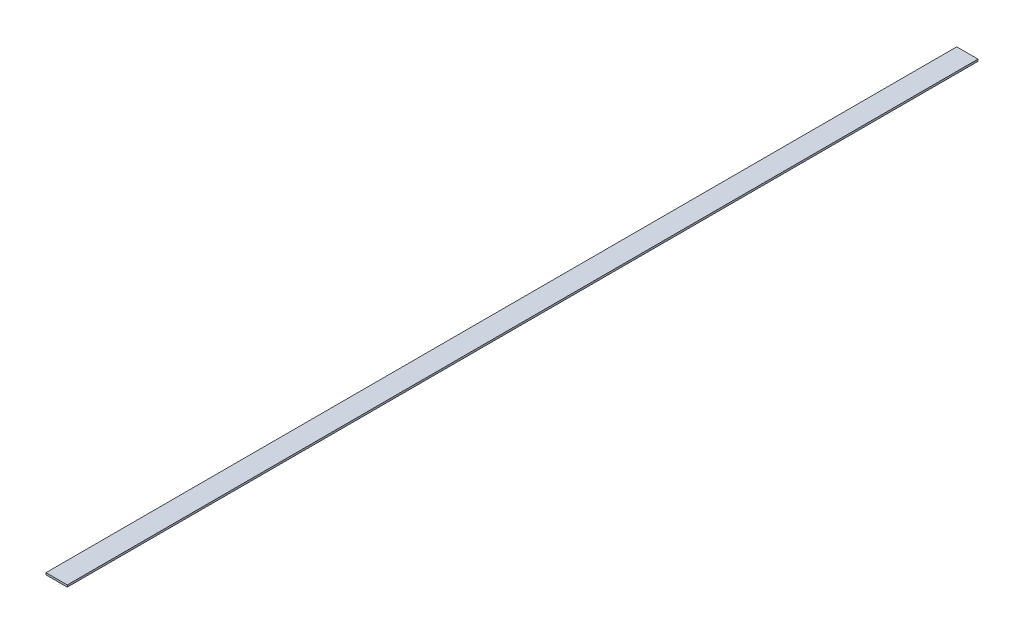
ISO-10303-21;
HEADER;
FILE_DESCRIPTION(('STEP AP214'),'2;1');
FILE_NAME('part.step','',(''),(''),'','','');
FILE_SCHEMA(('AUTOMOTIVE_DESIGN { 1 0 10303 214 1 1 1 1 }'));
ENDSEC;
DATA;
#1=APPLICATION_CONTEXT('core data for automotive mechanical design processes');
#2=APPLICATION_PROTOCOL_DEFINITION('international standard','automotive_design',2000,#1);
#3=PRODUCT_CONTEXT('',#1,'mechanical');
#4=PRODUCT('Part','Part','',(#3));
#5=PRODUCT_RELATED_PRODUCT_CATEGORY('part','',(#4));
#6=PRODUCT_DEFINITION_FORMATION('','',#4);
#7=PRODUCT_DEFINITION_CONTEXT('part definition',#1,'design');
#8=PRODUCT_DEFINITION('design','',#6,#7);
#9=PRODUCT_DEFINITION_SHAPE('','',#8);
#10=(LENGTH_UNIT() NAMED_UNIT(*) SI_UNIT(.MILLI.,.METRE.));
#11=(NAMED_UNIT(*) PLANE_ANGLE_UNIT() SI_UNIT($,.RADIAN.));
#12=(NAMED_UNIT(*) SI_UNIT($,.STERADIAN.) SOLID_ANGLE_UNIT());
#13=UNCERTAINTY_MEASURE_WITH_UNIT(LENGTH_MEASURE(1.E-05),#10,'distance_accuracy_value','');
#14=(GEOMETRIC_REPRESENTATION_CONTEXT(3) GLOBAL_UNCERTAINTY_ASSIGNED_CONTEXT((#13)) GLOBAL_UNIT_ASSIGNED_CONTEXT((#10,
#11,#12)) REPRESENTATION_CONTEXT('',''));
#15=CARTESIAN_POINT('',(0.,0.,0.));
#16=DIRECTION('',(0.,0.,1.));
#17=DIRECTION('',(1.,0.,0.));
#18=AXIS2_PLACEMENT_3D('',#15,#16,#17);
#19=CARTESIAN_POINT('',(0.,0.,925.));
#20=DIRECTION('',(1.,0.,0.));
#21=DIRECTION('',(0.,0.,-1.));
#22=AXIS2_PLACEMENT_3D('',#19,#20,#21);
#23=PLANE('',#22);
#24=DIRECTION('',(0.,-1.,0.));
#25=VECTOR('',#24,1.);
#26=CARTESIAN_POINT('',(0.,0.,0.));
#27=LINE('',#26,#25);
#28=CARTESIAN_POINT('',(0.,2.,0.));
#29=VERTEX_POINT('',#28);
#30=CARTESIAN_POINT('',(0.,0.,0.));
#31=VERTEX_POINT('',#30);
#32=EDGE_CURVE('E100',#29,#31,#27,.T.);
#33=ORIENTED_EDGE('',*,*,#32,.T.);
#34=DIRECTION('',(0.,0.,-1.));
#35=VECTOR('',#34,1.);
#36=CARTESIAN_POINT('',(0.,0.,925.));
#37=LINE('',#36,#35);
#38=CARTESIAN_POINT('',(0.,0.,925.));
#39=VERTEX_POINT('',#38);
#40=EDGE_CURVE('E11',#39,#31,#37,.T.);
#41=ORIENTED_EDGE('',*,*,#40,.F.);
#42=DIRECTION('',(0.,-1.,0.));
#43=VECTOR('',#42,1.);
#44=CARTESIAN_POINT('',(0.,0.,925.));
#45=LINE('',#44,#43);
#46=CARTESIAN_POINT('',(0.,2.,925.));
#47=VERTEX_POINT('',#46);
#48=EDGE_CURVE('E88',#47,#39,#45,.T.);
#49=ORIENTED_EDGE('',*,*,#48,.F.);
#50=DIRECTION('',(0.,0.,-1.));
#51=VECTOR('',#50,1.);
#52=CARTESIAN_POINT('',(0.,2.,925.));
#53=LINE('',#52,#51);
#54=EDGE_CURVE('E96',#47,#29,#53,.T.);
#55=ORIENTED_EDGE('',*,*,#54,.T.);
#56=EDGE_LOOP('',(#33,#41,#49,#55));
#57=FACE_BOUND('',#56,.T.);
#58=ADVANCED_FACE('F37',(#57),#23,.F.);
#59=CARTESIAN_POINT('',(0.,0.,925.));
#60=DIRECTION('',(0.,1.,0.));
#61=DIRECTION('',(0.,0.,1.));
#62=AXIS2_PLACEMENT_3D('',#59,#60,#61);
#63=PLANE('',#62);
#64=DIRECTION('',(1.,0.,0.));
#65=VECTOR('',#64,1.);
#66=CARTESIAN_POINT('',(0.,0.,0.));
#67=LINE('',#66,#65);
#68=CARTESIAN_POINT('',(21.6,0.,0.));
#69=VERTEX_POINT('',#68);
#70=EDGE_CURVE('E92',#31,#69,#67,.T.);
#71=ORIENTED_EDGE('',*,*,#70,.T.);
#72=DIRECTION('',(0.,0.,-1.));
#73=VECTOR('',#72,1.);
#74=CARTESIAN_POINT('',(21.6,0.,925.));
#75=LINE('',#74,#73);
#76=CARTESIAN_POINT('',(21.6,0.,925.));
#77=VERTEX_POINT('',#76);
#78=EDGE_CURVE('E45',#77,#69,#75,.T.);
#79=ORIENTED_EDGE('',*,*,#78,.F.);
#80=DIRECTION('',(1.,0.,0.));
#81=VECTOR('',#80,1.);
#82=CARTESIAN_POINT('',(0.,0.,925.));
#83=LINE('',#82,#81);
#84=EDGE_CURVE('E83',#39,#77,#83,.T.);
#85=ORIENTED_EDGE('',*,*,#84,.F.);
#86=ORIENTED_EDGE('',*,*,#40,.T.);
#87=EDGE_LOOP('',(#71,#79,#85,#86));
#88=FACE_BOUND('',#87,.T.);
#89=ADVANCED_FACE('F91',(#88),#63,.F.);
#90=CARTESIAN_POINT('',(21.6,0.,925.));
#91=DIRECTION('',(-1.,0.,0.));
#92=DIRECTION('',(0.,0.,1.));
#93=AXIS2_PLACEMENT_3D('',#90,#91,#92);
#94=PLANE('',#93);
#95=DIRECTION('',(0.,1.,0.));
#96=VECTOR('',#95,1.);
#97=CARTESIAN_POINT('',(21.6,0.,0.));
#98=LINE('',#97,#96);
#99=CARTESIAN_POINT('',(21.6,2.,0.));
#100=VERTEX_POINT('',#99);
#101=EDGE_CURVE('E70',#69,#100,#98,.T.);
#102=ORIENTED_EDGE('',*,*,#101,.T.);
#103=DIRECTION('',(0.,0.,-1.));
#104=VECTOR('',#103,1.);
#105=CARTESIAN_POINT('',(21.6,2.,925.));
#106=LINE('',#105,#104);
#107=CARTESIAN_POINT('',(21.6,2.,925.));
#108=VERTEX_POINT('',#107);
#109=EDGE_CURVE('E93',#108,#100,#106,.T.);
#110=ORIENTED_EDGE('',*,*,#109,.F.);
#111=DIRECTION('',(0.,1.,0.));
#112=VECTOR('',#111,1.);
#113=CARTESIAN_POINT('',(21.6,0.,925.));
#114=LINE('',#113,#112);
#115=EDGE_CURVE('E86',#77,#108,#114,.T.);
#116=ORIENTED_EDGE('',*,*,#115,.F.);
#117=ORIENTED_EDGE('',*,*,#78,.T.);
#118=EDGE_LOOP('',(#102,#110,#116,#117));
#119=FACE_BOUND('',#118,.T.);
#120=ADVANCED_FACE('F94',(#119),#94,.F.);
#121=CARTESIAN_POINT('',(0.,2.,925.));
#122=DIRECTION('',(0.,-1.,0.));
#123=DIRECTION('',(0.,0.,-1.));
#124=AXIS2_PLACEMENT_3D('',#121,#122,#123);
#125=PLANE('',#124);
#126=DIRECTION('',(-1.,0.,0.));
#127=VECTOR('',#126,1.);
#128=CARTESIAN_POINT('',(0.,2.,0.));
#129=LINE('',#128,#127);
#130=EDGE_CURVE('E76',#100,#29,#129,.T.);
#131=ORIENTED_EDGE('',*,*,#130,.T.);
#132=ORIENTED_EDGE('',*,*,#54,.F.);
#133=DIRECTION('',(-1.,0.,0.));
#134=VECTOR('',#133,1.);
#135=CARTESIAN_POINT('',(0.,2.,925.));
#136=LINE('',#135,#134);
#137=EDGE_CURVE('E53',#108,#47,#136,.T.);
#138=ORIENTED_EDGE('',*,*,#137,.F.);
#139=ORIENTED_EDGE('',*,*,#109,.T.);
#140=EDGE_LOOP('',(#131,#132,#138,#139));
#141=FACE_BOUND('',#140,.T.);
#142=ADVANCED_FACE('F107',(#141),#125,.F.);
#143=CARTESIAN_POINT('',(0.,0.,925.));
#144=DIRECTION('',(0.,0.,-1.));
#145=DIRECTION('',(-1.,0.,0.));
#146=AXIS2_PLACEMENT_3D('',#143,#144,#145);
#147=PLANE('',#146);
#148=ORIENTED_EDGE('',*,*,#48,.T.);
#149=ORIENTED_EDGE('',*,*,#84,.T.);
#150=ORIENTED_EDGE('',*,*,#115,.T.);
#151=ORIENTED_EDGE('',*,*,#137,.T.);
#152=EDGE_LOOP('',(#148,#149,#150,#151));
#153=FACE_BOUND('',#152,.T.);
#154=ADVANCED_FACE('F84',(#153),#147,.F.);
#155=CARTESIAN_POINT('',(0.,0.,0.));
#156=DIRECTION('',(0.,0.,-1.));
#157=DIRECTION('',(-1.,0.,0.));
#158=AXIS2_PLACEMENT_3D('',#155,#156,#157);
#159=PLANE('',#158);
#160=ORIENTED_EDGE('',*,*,#32,.F.);
#161=ORIENTED_EDGE('',*,*,#130,.F.);
#162=ORIENTED_EDGE('',*,*,#101,.F.);
#163=ORIENTED_EDGE('',*,*,#70,.F.);
#164=EDGE_LOOP('',(#160,#161,#162,#163));
#165=FACE_BOUND('',#164,.T.);
#166=ADVANCED_FACE('F110',(#165),#159,.T.);
#167=CLOSED_SHELL('',(#58,#89,#120,#142,#154,#166));
#168=MANIFOLD_SOLID_BREP('B2',#167);
#169=ADVANCED_BREP_SHAPE_REPRESENTATION('',(#18,#168),#14);
#170=SHAPE_DEFINITION_REPRESENTATION(#9,#169);
ENDSEC;
END-ISO-10303-21;
